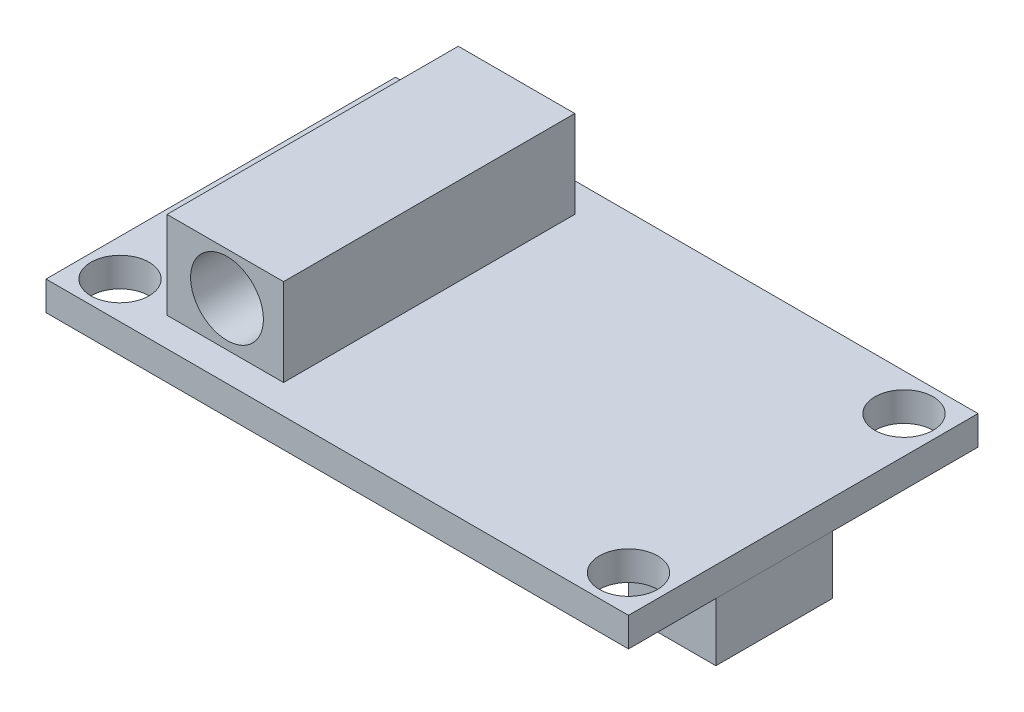
ISO-10303-21;
HEADER;
FILE_DESCRIPTION(('STEP AP214'),'2;1');
FILE_NAME('part.step','',(''),(''),'','','');
FILE_SCHEMA(('AUTOMOTIVE_DESIGN { 1 0 10303 214 1 1 1 1 }'));
ENDSEC;
DATA;
#1=APPLICATION_CONTEXT('core data for automotive mechanical design processes');
#2=APPLICATION_PROTOCOL_DEFINITION('international standard','automotive_design',2000,#1);
#3=PRODUCT_CONTEXT('',#1,'mechanical');
#4=PRODUCT('Part','Part','',(#3));
#5=PRODUCT_RELATED_PRODUCT_CATEGORY('part','',(#4));
#6=PRODUCT_DEFINITION_FORMATION('','',#4);
#7=PRODUCT_DEFINITION_CONTEXT('part definition',#1,'design');
#8=PRODUCT_DEFINITION('design','',#6,#7);
#9=PRODUCT_DEFINITION_SHAPE('','',#8);
#10=(LENGTH_UNIT() NAMED_UNIT(*) SI_UNIT(.MILLI.,.METRE.));
#11=(NAMED_UNIT(*) PLANE_ANGLE_UNIT() SI_UNIT($,.RADIAN.));
#12=(NAMED_UNIT(*) SI_UNIT($,.STERADIAN.) SOLID_ANGLE_UNIT());
#13=UNCERTAINTY_MEASURE_WITH_UNIT(LENGTH_MEASURE(1.E-05),#10,'distance_accuracy_value','');
#14=(GEOMETRIC_REPRESENTATION_CONTEXT(3) GLOBAL_UNCERTAINTY_ASSIGNED_CONTEXT((#13)) GLOBAL_UNIT_ASSIGNED_CONTEXT((#10,
#11,#12)) REPRESENTATION_CONTEXT('',''));
#15=CARTESIAN_POINT('',(0.,0.,0.));
#16=DIRECTION('',(0.,0.,1.));
#17=DIRECTION('',(1.,0.,0.));
#18=AXIS2_PLACEMENT_3D('',#15,#16,#17);
#19=CARTESIAN_POINT('',(11.1125,-3.175,0.));
#20=DIRECTION('',(-1.,0.,0.));
#21=DIRECTION('',(0.,0.,1.));
#22=AXIS2_PLACEMENT_3D('',#19,#20,#21);
#23=PLANE('',#22);
#24=DIRECTION('',(0.,0.,1.));
#25=VECTOR('',#24,1.);
#26=CARTESIAN_POINT('',(11.1125,0.,0.));
#27=LINE('',#26,#25);
#28=CARTESIAN_POINT('',(11.1125,0.,-1.5875));
#29=VERTEX_POINT('',#28);
#30=CARTESIAN_POINT('',(11.1125,0.,4.7625));
#31=VERTEX_POINT('',#30);
#32=EDGE_CURVE('E260',#29,#31,#27,.T.);
#33=ORIENTED_EDGE('',*,*,#32,.F.);
#34=DIRECTION('',(0.,1.,0.));
#35=VECTOR('',#34,1.);
#36=CARTESIAN_POINT('',(11.1125,-3.175,-1.5875));
#37=LINE('',#36,#35);
#38=CARTESIAN_POINT('',(11.1125,-3.175,-1.5875));
#39=VERTEX_POINT('',#38);
#40=EDGE_CURVE('E13',#39,#29,#37,.T.);
#41=ORIENTED_EDGE('',*,*,#40,.F.);
#42=DIRECTION('',(0.,0.,1.));
#43=VECTOR('',#42,1.);
#44=CARTESIAN_POINT('',(11.1125,-3.175,0.));
#45=LINE('',#44,#43);
#46=CARTESIAN_POINT('',(11.1125,-3.175,4.7625));
#47=VERTEX_POINT('',#46);
#48=EDGE_CURVE('E255',#39,#47,#45,.T.);
#49=ORIENTED_EDGE('',*,*,#48,.T.);
#50=DIRECTION('',(0.,1.,0.));
#51=VECTOR('',#50,1.);
#52=CARTESIAN_POINT('',(11.1125,-3.175,4.7625));
#53=LINE('',#52,#51);
#54=EDGE_CURVE('E198',#47,#31,#53,.T.);
#55=ORIENTED_EDGE('',*,*,#54,.T.);
#56=EDGE_LOOP('',(#33,#41,#49,#55));
#57=FACE_BOUND('',#56,.T.);
#58=ADVANCED_FACE('F195',(#57),#23,.T.);
#59=CARTESIAN_POINT('',(0.,-3.175,-1.5875));
#60=DIRECTION('',(0.,0.,1.));
#61=DIRECTION('',(1.,0.,0.));
#62=AXIS2_PLACEMENT_3D('',#59,#60,#61);
#63=PLANE('',#62);
#64=DIRECTION('',(1.,0.,0.));
#65=VECTOR('',#64,1.);
#66=CARTESIAN_POINT('',(0.,0.,-1.5875));
#67=LINE('',#66,#65);
#68=CARTESIAN_POINT('',(15.875,0.,-1.5875));
#69=VERTEX_POINT('',#68);
#70=EDGE_CURVE('E228',#29,#69,#67,.T.);
#71=ORIENTED_EDGE('',*,*,#70,.T.);
#72=DIRECTION('',(0.,1.,0.));
#73=VECTOR('',#72,1.);
#74=CARTESIAN_POINT('',(15.875,-3.175,-1.5875));
#75=LINE('',#74,#73);
#76=CARTESIAN_POINT('',(15.875,-3.175,-1.5875));
#77=VERTEX_POINT('',#76);
#78=EDGE_CURVE('E204',#77,#69,#75,.T.);
#79=ORIENTED_EDGE('',*,*,#78,.F.);
#80=DIRECTION('',(1.,0.,0.));
#81=VECTOR('',#80,1.);
#82=CARTESIAN_POINT('',(0.,-3.175,-1.5875));
#83=LINE('',#82,#81);
#84=EDGE_CURVE('E245',#39,#77,#83,.T.);
#85=ORIENTED_EDGE('',*,*,#84,.F.);
#86=ORIENTED_EDGE('',*,*,#40,.T.);
#87=EDGE_LOOP('',(#71,#79,#85,#86));
#88=FACE_BOUND('',#87,.T.);
#89=ADVANCED_FACE('F270',(#88),#63,.F.);
#90=CARTESIAN_POINT('',(15.875,-3.175,0.));
#91=DIRECTION('',(-1.,0.,0.));
#92=DIRECTION('',(0.,0.,1.));
#93=AXIS2_PLACEMENT_3D('',#90,#91,#92);
#94=PLANE('',#93);
#95=DIRECTION('',(0.,0.,1.));
#96=VECTOR('',#95,1.);
#97=CARTESIAN_POINT('',(15.875,0.,0.));
#98=LINE('',#97,#96);
#99=CARTESIAN_POINT('',(15.875,0.,4.7625));
#100=VERTEX_POINT('',#99);
#101=EDGE_CURVE('E252',#69,#100,#98,.T.);
#102=ORIENTED_EDGE('',*,*,#101,.T.);
#103=DIRECTION('',(0.,1.,0.));
#104=VECTOR('',#103,1.);
#105=CARTESIAN_POINT('',(15.875,-3.175,4.7625));
#106=LINE('',#105,#104);
#107=CARTESIAN_POINT('',(15.875,-3.175,4.7625));
#108=VERTEX_POINT('',#107);
#109=EDGE_CURVE('E249',#108,#100,#106,.T.);
#110=ORIENTED_EDGE('',*,*,#109,.F.);
#111=DIRECTION('',(0.,0.,1.));
#112=VECTOR('',#111,1.);
#113=CARTESIAN_POINT('',(15.875,-3.175,0.));
#114=LINE('',#113,#112);
#115=EDGE_CURVE('E240',#77,#108,#114,.T.);
#116=ORIENTED_EDGE('',*,*,#115,.F.);
#117=ORIENTED_EDGE('',*,*,#78,.T.);
#118=EDGE_LOOP('',(#102,#110,#116,#117));
#119=FACE_BOUND('',#118,.T.);
#120=ADVANCED_FACE('F250',(#119),#94,.F.);
#121=CARTESIAN_POINT('',(0.,-3.175,4.7625));
#122=DIRECTION('',(0.,0.,1.));
#123=DIRECTION('',(1.,0.,0.));
#124=AXIS2_PLACEMENT_3D('',#121,#122,#123);
#125=PLANE('',#124);
#126=DIRECTION('',(1.,0.,0.));
#127=VECTOR('',#126,1.);
#128=CARTESIAN_POINT('',(0.,0.,4.7625));
#129=LINE('',#128,#127);
#130=EDGE_CURVE('E263',#31,#100,#129,.T.);
#131=ORIENTED_EDGE('',*,*,#130,.F.);
#132=ORIENTED_EDGE('',*,*,#54,.F.);
#133=DIRECTION('',(1.,0.,0.));
#134=VECTOR('',#133,1.);
#135=CARTESIAN_POINT('',(0.,-3.175,4.7625));
#136=LINE('',#135,#134);
#137=EDGE_CURVE('E244',#47,#108,#136,.T.);
#138=ORIENTED_EDGE('',*,*,#137,.T.);
#139=ORIENTED_EDGE('',*,*,#109,.T.);
#140=EDGE_LOOP('',(#131,#132,#138,#139));
#141=FACE_BOUND('',#140,.T.);
#142=ADVANCED_FACE('F254',(#141),#125,.T.);
#143=CARTESIAN_POINT('',(0.,-3.175,0.));
#144=DIRECTION('',(0.,1.,0.));
#145=DIRECTION('',(0.,0.,1.));
#146=AXIS2_PLACEMENT_3D('',#143,#144,#145);
#147=PLANE('',#146);
#148=ORIENTED_EDGE('',*,*,#48,.F.);
#149=ORIENTED_EDGE('',*,*,#84,.T.);
#150=ORIENTED_EDGE('',*,*,#115,.T.);
#151=ORIENTED_EDGE('',*,*,#137,.F.);
#152=EDGE_LOOP('',(#148,#149,#150,#151));
#153=FACE_BOUND('',#152,.T.);
#154=ADVANCED_FACE('F243',(#153),#147,.F.);
#155=CARTESIAN_POINT('',(0.,0.,0.));
#156=DIRECTION('',(0.,1.,0.));
#157=DIRECTION('',(0.,0.,1.));
#158=AXIS2_PLACEMENT_3D('',#155,#156,#157);
#159=PLANE('',#158);
#160=ORIENTED_EDGE('',*,*,#32,.T.);
#161=ORIENTED_EDGE('',*,*,#130,.T.);
#162=ORIENTED_EDGE('',*,*,#101,.F.);
#163=ORIENTED_EDGE('',*,*,#70,.F.);
#164=EDGE_LOOP('',(#160,#161,#162,#163));
#165=FACE_BOUND('',#164,.T.);
#166=ADVANCED_FACE('F268',(#165),#159,.T.);
#167=CLOSED_SHELL('',(#58,#89,#120,#142,#154,#166));
#168=MANIFOLD_SOLID_BREP('B2',#167);
#169=CARTESIAN_POINT('',(-11.1125,-3.175,0.));
#170=DIRECTION('',(-1.,0.,0.));
#171=DIRECTION('',(0.,0.,1.));
#172=AXIS2_PLACEMENT_3D('',#169,#170,#171);
#173=PLANE('',#172);
#174=DIRECTION('',(0.,0.,1.));
#175=VECTOR('',#174,1.);
#176=CARTESIAN_POINT('',(-11.1125,0.,0.));
#177=LINE('',#176,#175);
#178=CARTESIAN_POINT('',(-11.1125,0.,-5.55625000000001));
#179=VERTEX_POINT('',#178);
#180=CARTESIAN_POINT('',(-11.1125,0.,0.793749999999992));
#181=VERTEX_POINT('',#180);
#182=EDGE_CURVE('E404',#179,#181,#177,.T.);
#183=ORIENTED_EDGE('',*,*,#182,.T.);
#184=DIRECTION('',(0.,1.,0.));
#185=VECTOR('',#184,1.);
#186=CARTESIAN_POINT('',(-11.1125,-3.175,0.793749999999992));
#187=LINE('',#186,#185);
#188=CARTESIAN_POINT('',(-11.1125,-3.175,0.793749999999992));
#189=VERTEX_POINT('',#188);
#190=EDGE_CURVE('E193',#189,#181,#187,.T.);
#191=ORIENTED_EDGE('',*,*,#190,.F.);
#192=DIRECTION('',(0.,0.,1.));
#193=VECTOR('',#192,1.);
#194=CARTESIAN_POINT('',(-11.1125,-3.175,0.));
#195=LINE('',#194,#193);
#196=CARTESIAN_POINT('',(-11.1125,-3.175,-5.55625000000001));
#197=VERTEX_POINT('',#196);
#198=EDGE_CURVE('E360',#197,#189,#195,.T.);
#199=ORIENTED_EDGE('',*,*,#198,.F.);
#200=DIRECTION('',(0.,1.,0.));
#201=VECTOR('',#200,1.);
#202=CARTESIAN_POINT('',(-11.1125,-3.175,-5.55625000000001));
#203=LINE('',#202,#201);
#204=EDGE_CURVE('E345',#197,#179,#203,.T.);
#205=ORIENTED_EDGE('',*,*,#204,.T.);
#206=EDGE_LOOP('',(#183,#191,#199,#205));
#207=FACE_BOUND('',#206,.T.);
#208=ADVANCED_FACE('F342',(#207),#173,.F.);
#209=CARTESIAN_POINT('',(0.,-3.175,0.793749999999989));
#210=DIRECTION('',(0.,0.,1.));
#211=DIRECTION('',(1.,0.,0.));
#212=AXIS2_PLACEMENT_3D('',#209,#210,#211);
#213=PLANE('',#212);
#214=DIRECTION('',(1.,0.,0.));
#215=VECTOR('',#214,1.);
#216=CARTESIAN_POINT('',(0.,0.,0.793749999999989));
#217=LINE('',#216,#215);
#218=CARTESIAN_POINT('',(-15.875,0.,0.793749999999992));
#219=VERTEX_POINT('',#218);
#220=EDGE_CURVE('E409',#219,#181,#217,.T.);
#221=ORIENTED_EDGE('',*,*,#220,.F.);
#222=DIRECTION('',(0.,1.,0.));
#223=VECTOR('',#222,1.);
#224=CARTESIAN_POINT('',(-15.875,-3.175,0.793749999999992));
#225=LINE('',#224,#223);
#226=CARTESIAN_POINT('',(-15.875,-3.175,0.793749999999992));
#227=VERTEX_POINT('',#226);
#228=EDGE_CURVE('E351',#227,#219,#225,.T.);
#229=ORIENTED_EDGE('',*,*,#228,.F.);
#230=DIRECTION('',(1.,0.,0.));
#231=VECTOR('',#230,1.);
#232=CARTESIAN_POINT('',(0.,-3.175,0.793749999999989));
#233=LINE('',#232,#231);
#234=EDGE_CURVE('E399',#227,#189,#233,.T.);
#235=ORIENTED_EDGE('',*,*,#234,.T.);
#236=ORIENTED_EDGE('',*,*,#190,.T.);
#237=EDGE_LOOP('',(#221,#229,#235,#236));
#238=FACE_BOUND('',#237,.T.);
#239=ADVANCED_FACE('F415',(#238),#213,.T.);
#240=CARTESIAN_POINT('',(-15.875,-3.175,0.));
#241=DIRECTION('',(-1.,0.,0.));
#242=DIRECTION('',(0.,0.,1.));
#243=AXIS2_PLACEMENT_3D('',#240,#241,#242);
#244=PLANE('',#243);
#245=DIRECTION('',(0.,0.,1.));
#246=VECTOR('',#245,1.);
#247=CARTESIAN_POINT('',(-15.875,0.,0.));
#248=LINE('',#247,#246);
#249=CARTESIAN_POINT('',(-15.875,0.,-5.55625000000001));
#250=VERTEX_POINT('',#249);
#251=EDGE_CURVE('E392',#250,#219,#248,.T.);
#252=ORIENTED_EDGE('',*,*,#251,.F.);
#253=DIRECTION('',(0.,1.,0.));
#254=VECTOR('',#253,1.);
#255=CARTESIAN_POINT('',(-15.875,-3.175,-5.55625000000001));
#256=LINE('',#255,#254);
#257=CARTESIAN_POINT('',(-15.875,-3.175,-5.55625000000001));
#258=VERTEX_POINT('',#257);
#259=EDGE_CURVE('E389',#258,#250,#256,.T.);
#260=ORIENTED_EDGE('',*,*,#259,.F.);
#261=DIRECTION('',(0.,0.,1.));
#262=VECTOR('',#261,1.);
#263=CARTESIAN_POINT('',(-15.875,-3.175,0.));
#264=LINE('',#263,#262);
#265=EDGE_CURVE('E391',#258,#227,#264,.T.);
#266=ORIENTED_EDGE('',*,*,#265,.T.);
#267=ORIENTED_EDGE('',*,*,#228,.T.);
#268=EDGE_LOOP('',(#252,#260,#266,#267));
#269=FACE_BOUND('',#268,.T.);
#270=ADVANCED_FACE('F390',(#269),#244,.T.);
#271=CARTESIAN_POINT('',(0.,-3.175,-5.55625000000001));
#272=DIRECTION('',(0.,0.,1.));
#273=DIRECTION('',(1.,0.,0.));
#274=AXIS2_PLACEMENT_3D('',#271,#272,#273);
#275=PLANE('',#274);
#276=DIRECTION('',(1.,0.,0.));
#277=VECTOR('',#276,1.);
#278=CARTESIAN_POINT('',(0.,0.,-5.55625000000001));
#279=LINE('',#278,#277);
#280=EDGE_CURVE('E406',#250,#179,#279,.T.);
#281=ORIENTED_EDGE('',*,*,#280,.T.);
#282=ORIENTED_EDGE('',*,*,#204,.F.);
#283=DIRECTION('',(1.,0.,0.));
#284=VECTOR('',#283,1.);
#285=CARTESIAN_POINT('',(0.,-3.175,-5.55625000000001));
#286=LINE('',#285,#284);
#287=EDGE_CURVE('E386',#258,#197,#286,.T.);
#288=ORIENTED_EDGE('',*,*,#287,.F.);
#289=ORIENTED_EDGE('',*,*,#259,.T.);
#290=EDGE_LOOP('',(#281,#282,#288,#289));
#291=FACE_BOUND('',#290,.T.);
#292=ADVANCED_FACE('F395',(#291),#275,.F.);
#293=CARTESIAN_POINT('',(0.,-3.175,0.));
#294=DIRECTION('',(0.,1.,0.));
#295=DIRECTION('',(0.,0.,1.));
#296=AXIS2_PLACEMENT_3D('',#293,#294,#295);
#297=PLANE('',#296);
#298=ORIENTED_EDGE('',*,*,#198,.T.);
#299=ORIENTED_EDGE('',*,*,#234,.F.);
#300=ORIENTED_EDGE('',*,*,#265,.F.);
#301=ORIENTED_EDGE('',*,*,#287,.T.);
#302=EDGE_LOOP('',(#298,#299,#300,#301));
#303=FACE_BOUND('',#302,.T.);
#304=ADVANCED_FACE('F398',(#303),#297,.F.);
#305=CARTESIAN_POINT('',(0.,0.,0.));
#306=DIRECTION('',(0.,1.,0.));
#307=DIRECTION('',(0.,0.,1.));
#308=AXIS2_PLACEMENT_3D('',#305,#306,#307);
#309=PLANE('',#308);
#310=ORIENTED_EDGE('',*,*,#182,.F.);
#311=ORIENTED_EDGE('',*,*,#280,.F.);
#312=ORIENTED_EDGE('',*,*,#251,.T.);
#313=ORIENTED_EDGE('',*,*,#220,.T.);
#314=EDGE_LOOP('',(#310,#311,#312,#313));
#315=FACE_BOUND('',#314,.T.);
#316=ADVANCED_FACE('F414',(#315),#309,.T.);
#317=CLOSED_SHELL('',(#208,#239,#270,#292,#304,#316));
#318=MANIFOLD_SOLID_BREP('B7',#317);
#319=CARTESIAN_POINT('',(13.8580942622951,1.5875,-7.50809426229511));
#320=DIRECTION('',(0.,-1.,0.));
#321=DIRECTION('',(0.,0.,-1.));
#322=AXIS2_PLACEMENT_3D('',#319,#320,#321);
#323=CYLINDRICAL_SURFACE('',#322,1.5875);
#324=CARTESIAN_POINT('',(13.8580942622951,1.5875,-7.50809426229511));
#325=DIRECTION('',(0.,1.,0.));
#326=DIRECTION('',(0.,0.,1.));
#327=AXIS2_PLACEMENT_3D('',#324,#325,#326);
#328=CIRCLE('',#327,1.5875);
#329=CARTESIAN_POINT('',(13.8580942622951,1.5875,-5.92059426229511));
#330=VERTEX_POINT('',#329);
#331=EDGE_CURVE('E606',#330,#330,#328,.F.);
#332=ORIENTED_EDGE('',*,*,#331,.F.);
#333=EDGE_LOOP('',(#332));
#334=FACE_BOUND('',#333,.T.);
#335=CARTESIAN_POINT('',(13.8580942622951,0.,-7.50809426229511));
#336=DIRECTION('',(0.,1.,0.));
#337=DIRECTION('',(0.,0.,1.));
#338=AXIS2_PLACEMENT_3D('',#335,#336,#337);
#339=CIRCLE('',#338,1.5875);
#340=CARTESIAN_POINT('',(13.8580942622951,0.,-5.92059426229511));
#341=VERTEX_POINT('',#340);
#342=EDGE_CURVE('E590',#341,#341,#339,.F.);
#343=ORIENTED_EDGE('',*,*,#342,.T.);
#344=EDGE_LOOP('',(#343));
#345=FACE_BOUND('',#344,.T.);
#346=ADVANCED_FACE('F480',(#334,#345),#323,.F.);
#347=CARTESIAN_POINT('',(13.8580942622951,1.5875,7.50809426229509));
#348=DIRECTION('',(0.,-1.,0.));
#349=DIRECTION('',(0.,0.,-1.));
#350=AXIS2_PLACEMENT_3D('',#347,#348,#349);
#351=CYLINDRICAL_SURFACE('',#350,1.5875);
#352=CARTESIAN_POINT('',(13.8580942622951,1.5875,7.50809426229509));
#353=DIRECTION('',(0.,1.,0.));
#354=DIRECTION('',(0.,0.,1.));
#355=AXIS2_PLACEMENT_3D('',#352,#353,#354);
#356=CIRCLE('',#355,1.5875);
#357=CARTESIAN_POINT('',(13.8580942622951,1.5875,9.09559426229509));
#358=VERTEX_POINT('',#357);
#359=EDGE_CURVE('E603',#358,#358,#356,.T.);
#360=ORIENTED_EDGE('',*,*,#359,.T.);
#361=EDGE_LOOP('',(#360));
#362=FACE_BOUND('',#361,.T.);
#363=CARTESIAN_POINT('',(13.8580942622951,0.,7.50809426229509));
#364=DIRECTION('',(0.,1.,0.));
#365=DIRECTION('',(0.,0.,1.));
#366=AXIS2_PLACEMENT_3D('',#363,#364,#365);
#367=CIRCLE('',#366,1.5875);
#368=CARTESIAN_POINT('',(13.8580942622951,0.,9.09559426229509));
#369=VERTEX_POINT('',#368);
#370=EDGE_CURVE('E619',#369,#369,#367,.T.);
#371=ORIENTED_EDGE('',*,*,#370,.F.);
#372=EDGE_LOOP('',(#371));
#373=FACE_BOUND('',#372,.T.);
#374=ADVANCED_FACE('F668',(#362,#373),#351,.F.);
#375=CARTESIAN_POINT('',(0.,1.5875,-9.525));
#376=DIRECTION('',(0.,0.,-1.));
#377=DIRECTION('',(-1.,0.,0.));
#378=AXIS2_PLACEMENT_3D('',#375,#376,#377);
#379=PLANE('',#378);
#380=DIRECTION('',(1.,0.,0.));
#381=VECTOR('',#380,1.);
#382=CARTESIAN_POINT('',(0.,0.,-9.525));
#383=LINE('',#382,#381);
#384=CARTESIAN_POINT('',(-15.875,0.,-9.525));
#385=VERTEX_POINT('',#384);
#386=CARTESIAN_POINT('',(15.875,0.,-9.525));
#387=VERTEX_POINT('',#386);
#388=EDGE_CURVE('E615',#385,#387,#383,.T.);
#389=ORIENTED_EDGE('',*,*,#388,.F.);
#390=DIRECTION('',(0.,-1.,0.));
#391=VECTOR('',#390,1.);
#392=CARTESIAN_POINT('',(-15.875,1.5875,-9.525));
#393=LINE('',#392,#391);
#394=CARTESIAN_POINT('',(-15.875,1.5875,-9.525));
#395=VERTEX_POINT('',#394);
#396=EDGE_CURVE('E488',#395,#385,#393,.T.);
#397=ORIENTED_EDGE('',*,*,#396,.F.);
#398=DIRECTION('',(1.,0.,0.));
#399=VECTOR('',#398,1.);
#400=CARTESIAN_POINT('',(0.,1.5875,-9.525));
#401=LINE('',#400,#399);
#402=CARTESIAN_POINT('',(15.875,1.5875,-9.525));
#403=VERTEX_POINT('',#402);
#404=EDGE_CURVE('E595',#395,#403,#401,.T.);
#405=ORIENTED_EDGE('',*,*,#404,.T.);
#406=DIRECTION('',(0.,-1.,0.));
#407=VECTOR('',#406,1.);
#408=CARTESIAN_POINT('',(15.875,1.5875,-9.525));
#409=LINE('',#408,#407);
#410=EDGE_CURVE('E340',#403,#387,#409,.T.);
#411=ORIENTED_EDGE('',*,*,#410,.T.);
#412=EDGE_LOOP('',(#389,#397,#405,#411));
#413=FACE_BOUND('',#412,.T.);
#414=ADVANCED_FACE('F643',(#413),#379,.T.);
#415=CARTESIAN_POINT('',(-15.875,1.5875,0.));
#416=DIRECTION('',(1.,0.,0.));
#417=DIRECTION('',(0.,0.,-1.));
#418=AXIS2_PLACEMENT_3D('',#415,#416,#417);
#419=PLANE('',#418);
#420=DIRECTION('',(0.,0.,1.));
#421=VECTOR('',#420,1.);
#422=CARTESIAN_POINT('',(-15.875,0.,0.));
#423=LINE('',#422,#421);
#424=CARTESIAN_POINT('',(-15.875,0.,9.525));
#425=VERTEX_POINT('',#424);
#426=EDGE_CURVE('E623',#385,#425,#423,.T.);
#427=ORIENTED_EDGE('',*,*,#426,.T.);
#428=DIRECTION('',(0.,-1.,0.));
#429=VECTOR('',#428,1.);
#430=CARTESIAN_POINT('',(-15.875,1.5875,9.525));
#431=LINE('',#430,#429);
#432=CARTESIAN_POINT('',(-15.875,1.5875,9.525));
#433=VERTEX_POINT('',#432);
#434=EDGE_CURVE('E633',#433,#425,#431,.T.);
#435=ORIENTED_EDGE('',*,*,#434,.F.);
#436=DIRECTION('',(0.,0.,1.));
#437=VECTOR('',#436,1.);
#438=CARTESIAN_POINT('',(-15.875,1.5875,0.));
#439=LINE('',#438,#437);
#440=EDGE_CURVE('E598',#395,#433,#439,.T.);
#441=ORIENTED_EDGE('',*,*,#440,.F.);
#442=ORIENTED_EDGE('',*,*,#396,.T.);
#443=EDGE_LOOP('',(#427,#435,#441,#442));
#444=FACE_BOUND('',#443,.T.);
#445=ADVANCED_FACE('F639',(#444),#419,.F.);
#446=CARTESIAN_POINT('',(0.,1.5875,9.525));
#447=DIRECTION('',(0.,0.,-1.));
#448=DIRECTION('',(-1.,0.,0.));
#449=AXIS2_PLACEMENT_3D('',#446,#447,#448);
#450=PLANE('',#449);
#451=DIRECTION('',(1.,0.,0.));
#452=VECTOR('',#451,1.);
#453=CARTESIAN_POINT('',(0.,0.,9.525));
#454=LINE('',#453,#452);
#455=CARTESIAN_POINT('',(15.875,0.,9.525));
#456=VERTEX_POINT('',#455);
#457=EDGE_CURVE('E620',#425,#456,#454,.T.);
#458=ORIENTED_EDGE('',*,*,#457,.T.);
#459=DIRECTION('',(0.,-1.,0.));
#460=VECTOR('',#459,1.);
#461=CARTESIAN_POINT('',(15.875,1.5875,9.525));
#462=LINE('',#461,#460);
#463=CARTESIAN_POINT('',(15.875,1.5875,9.525));
#464=VERTEX_POINT('',#463);
#465=EDGE_CURVE('E609',#464,#456,#462,.T.);
#466=ORIENTED_EDGE('',*,*,#465,.F.);
#467=DIRECTION('',(1.,0.,0.));
#468=VECTOR('',#467,1.);
#469=CARTESIAN_POINT('',(0.,1.5875,9.525));
#470=LINE('',#469,#468);
#471=EDGE_CURVE('E600',#433,#464,#470,.T.);
#472=ORIENTED_EDGE('',*,*,#471,.F.);
#473=ORIENTED_EDGE('',*,*,#434,.T.);
#474=EDGE_LOOP('',(#458,#466,#472,#473));
#475=FACE_BOUND('',#474,.T.);
#476=ADVANCED_FACE('F650',(#475),#450,.F.);
#477=CARTESIAN_POINT('',(15.875,1.5875,0.));
#478=DIRECTION('',(1.,0.,0.));
#479=DIRECTION('',(0.,0.,-1.));
#480=AXIS2_PLACEMENT_3D('',#477,#478,#479);
#481=PLANE('',#480);
#482=DIRECTION('',(0.,0.,1.));
#483=VECTOR('',#482,1.);
#484=CARTESIAN_POINT('',(15.875,0.,0.));
#485=LINE('',#484,#483);
#486=EDGE_CURVE('E616',#387,#456,#485,.T.);
#487=ORIENTED_EDGE('',*,*,#486,.F.);
#488=ORIENTED_EDGE('',*,*,#410,.F.);
#489=DIRECTION('',(0.,0.,1.));
#490=VECTOR('',#489,1.);
#491=CARTESIAN_POINT('',(15.875,1.5875,0.));
#492=LINE('',#491,#490);
#493=EDGE_CURVE('E593',#403,#464,#492,.T.);
#494=ORIENTED_EDGE('',*,*,#493,.T.);
#495=ORIENTED_EDGE('',*,*,#465,.T.);
#496=EDGE_LOOP('',(#487,#488,#494,#495));
#497=FACE_BOUND('',#496,.T.);
#498=ADVANCED_FACE('F656',(#497),#481,.T.);
#499=CARTESIAN_POINT('',(-13.8580942622951,1.5875,-7.5080942622951));
#500=DIRECTION('',(0.,-1.,0.));
#501=DIRECTION('',(0.,0.,-1.));
#502=AXIS2_PLACEMENT_3D('',#499,#500,#501);
#503=CYLINDRICAL_SURFACE('',#502,1.5875);
#504=CARTESIAN_POINT('',(-13.8580942622951,1.5875,-7.5080942622951));
#505=DIRECTION('',(0.,1.,0.));
#506=DIRECTION('',(0.,0.,1.));
#507=AXIS2_PLACEMENT_3D('',#504,#505,#506);
#508=CIRCLE('',#507,1.5875);
#509=CARTESIAN_POINT('',(-13.8580942622951,1.5875,-5.9205942622951));
#510=VERTEX_POINT('',#509);
#511=EDGE_CURVE('E589',#510,#510,#508,.T.);
#512=ORIENTED_EDGE('',*,*,#511,.T.);
#513=EDGE_LOOP('',(#512));
#514=FACE_BOUND('',#513,.T.);
#515=CARTESIAN_POINT('',(-13.8580942622951,0.,-7.5080942622951));
#516=DIRECTION('',(0.,1.,0.));
#517=DIRECTION('',(0.,0.,1.));
#518=AXIS2_PLACEMENT_3D('',#515,#516,#517);
#519=CIRCLE('',#518,1.5875);
#520=CARTESIAN_POINT('',(-13.8580942622951,0.,-5.9205942622951));
#521=VERTEX_POINT('',#520);
#522=EDGE_CURVE('E612',#521,#521,#519,.T.);
#523=ORIENTED_EDGE('',*,*,#522,.F.);
#524=EDGE_LOOP('',(#523));
#525=FACE_BOUND('',#524,.T.);
#526=ADVANCED_FACE('F658',(#514,#525),#503,.F.);
#527=CARTESIAN_POINT('',(-13.8580942622951,1.5875,7.5080942622951));
#528=DIRECTION('',(0.,-1.,0.));
#529=DIRECTION('',(0.,0.,-1.));
#530=AXIS2_PLACEMENT_3D('',#527,#528,#529);
#531=CYLINDRICAL_SURFACE('',#530,1.5875);
#532=CARTESIAN_POINT('',(-13.8580942622951,1.5875,7.5080942622951));
#533=DIRECTION('',(0.,1.,0.));
#534=DIRECTION('',(0.,0.,1.));
#535=AXIS2_PLACEMENT_3D('',#532,#533,#534);
#536=CIRCLE('',#535,1.5875);
#537=CARTESIAN_POINT('',(-13.8580942622951,1.5875,9.0955942622951));
#538=VERTEX_POINT('',#537);
#539=EDGE_CURVE('E586',#538,#538,#536,.F.);
#540=ORIENTED_EDGE('',*,*,#539,.F.);
#541=EDGE_LOOP('',(#540));
#542=FACE_BOUND('',#541,.T.);
#543=CARTESIAN_POINT('',(-13.8580942622951,0.,7.5080942622951));
#544=DIRECTION('',(0.,1.,0.));
#545=DIRECTION('',(0.,0.,1.));
#546=AXIS2_PLACEMENT_3D('',#543,#544,#545);
#547=CIRCLE('',#546,1.5875);
#548=CARTESIAN_POINT('',(-13.8580942622951,0.,9.0955942622951));
#549=VERTEX_POINT('',#548);
#550=EDGE_CURVE('E581',#549,#549,#547,.F.);
#551=ORIENTED_EDGE('',*,*,#550,.T.);
#552=EDGE_LOOP('',(#551));
#553=FACE_BOUND('',#552,.T.);
#554=ADVANCED_FACE('F482',(#542,#553),#531,.F.);
#555=CARTESIAN_POINT('',(0.,0.,0.));
#556=DIRECTION('',(0.,1.,0.));
#557=DIRECTION('',(0.,0.,1.));
#558=AXIS2_PLACEMENT_3D('',#555,#556,#557);
#559=PLANE('',#558);
#560=ORIENTED_EDGE('',*,*,#388,.T.);
#561=ORIENTED_EDGE('',*,*,#486,.T.);
#562=ORIENTED_EDGE('',*,*,#457,.F.);
#563=ORIENTED_EDGE('',*,*,#426,.F.);
#564=EDGE_LOOP('',(#560,#561,#562,#563));
#565=FACE_BOUND('',#564,.T.);
#566=ORIENTED_EDGE('',*,*,#550,.F.);
#567=EDGE_LOOP('',(#566));
#568=FACE_BOUND('',#567,.T.);
#569=ORIENTED_EDGE('',*,*,#522,.T.);
#570=EDGE_LOOP('',(#569));
#571=FACE_BOUND('',#570,.T.);
#572=ORIENTED_EDGE('',*,*,#370,.T.);
#573=EDGE_LOOP('',(#572));
#574=FACE_BOUND('',#573,.T.);
#575=ORIENTED_EDGE('',*,*,#342,.F.);
#576=EDGE_LOOP('',(#575));
#577=FACE_BOUND('',#576,.T.);
#578=ADVANCED_FACE('F645',(#565,#568,#571,#574,#577),#559,.F.);
#579=CARTESIAN_POINT('',(0.,1.5875,0.));
#580=DIRECTION('',(0.,1.,0.));
#581=DIRECTION('',(0.,0.,1.));
#582=AXIS2_PLACEMENT_3D('',#579,#580,#581);
#583=PLANE('',#582);
#584=DIRECTION('',(-1.,0.,0.));
#585=VECTOR('',#584,1.);
#586=CARTESIAN_POINT('',(0.,1.5875,7.93749999999999));
#587=LINE('',#586,#585);
#588=CARTESIAN_POINT('',(-4.51526639344264,1.5875,7.93749999999999));
#589=VERTEX_POINT('',#588);
#590=CARTESIAN_POINT('',(-10.8652663934426,1.5875,7.93749999999999));
#591=VERTEX_POINT('',#590);
#592=EDGE_CURVE('E575',#589,#591,#587,.T.);
#593=ORIENTED_EDGE('',*,*,#592,.T.);
#594=DIRECTION('',(0.,0.,-1.));
#595=VECTOR('',#594,1.);
#596=CARTESIAN_POINT('',(-10.8652663934426,1.5875,0.));
#597=LINE('',#596,#595);
#598=CARTESIAN_POINT('',(-10.8652663934426,1.5875,-7.93750000000001));
#599=VERTEX_POINT('',#598);
#600=EDGE_CURVE('E549',#591,#599,#597,.T.);
#601=ORIENTED_EDGE('',*,*,#600,.T.);
#602=DIRECTION('',(-1.,0.,0.));
#603=VECTOR('',#602,1.);
#604=CARTESIAN_POINT('',(0.,1.5875,-7.93750000000001));
#605=LINE('',#604,#603);
#606=CARTESIAN_POINT('',(-4.51526639344264,1.5875,-7.93750000000001));
#607=VERTEX_POINT('',#606);
#608=EDGE_CURVE('E500',#607,#599,#605,.T.);
#609=ORIENTED_EDGE('',*,*,#608,.F.);
#610=DIRECTION('',(0.,0.,-1.));
#611=VECTOR('',#610,1.);
#612=CARTESIAN_POINT('',(-4.51526639344264,1.5875,0.));
#613=LINE('',#612,#611);
#614=EDGE_CURVE('E495',#589,#607,#613,.T.);
#615=ORIENTED_EDGE('',*,*,#614,.F.);
#616=EDGE_LOOP('',(#593,#601,#609,#615));
#617=FACE_BOUND('',#616,.T.);
#618=ORIENTED_EDGE('',*,*,#471,.T.);
#619=ORIENTED_EDGE('',*,*,#493,.F.);
#620=ORIENTED_EDGE('',*,*,#404,.F.);
#621=ORIENTED_EDGE('',*,*,#440,.T.);
#622=EDGE_LOOP('',(#618,#619,#620,#621));
#623=FACE_BOUND('',#622,.T.);
#624=ORIENTED_EDGE('',*,*,#539,.T.);
#625=EDGE_LOOP('',(#624));
#626=FACE_BOUND('',#625,.T.);
#627=ORIENTED_EDGE('',*,*,#511,.F.);
#628=EDGE_LOOP('',(#627));
#629=FACE_BOUND('',#628,.T.);
#630=ORIENTED_EDGE('',*,*,#359,.F.);
#631=EDGE_LOOP('',(#630));
#632=FACE_BOUND('',#631,.T.);
#633=ORIENTED_EDGE('',*,*,#331,.T.);
#634=EDGE_LOOP('',(#633));
#635=FACE_BOUND('',#634,.T.);
#636=ADVANCED_FACE('F653',(#617,#623,#626,#629,#632,#635),#583,.T.);
#637=CARTESIAN_POINT('',(0.,6.35,7.93749999999999));
#638=DIRECTION('',(0.,0.,1.));
#639=DIRECTION('',(1.,0.,0.));
#640=AXIS2_PLACEMENT_3D('',#637,#638,#639);
#641=PLANE('',#640);
#642=CARTESIAN_POINT('',(-7.59661036465575,4.0184153166899,7.93749999999999));
#643=DIRECTION('',(0.,0.,1.));
#644=DIRECTION('',(1.,0.,0.));
#645=AXIS2_PLACEMENT_3D('',#642,#643,#644);
#646=CIRCLE('',#645,1.984375);
#647=CARTESIAN_POINT('',(-5.61223536465575,4.0184153166899,7.93749999999999));
#648=VERTEX_POINT('',#647);
#649=EDGE_CURVE('E570',#648,#648,#646,.T.);
#650=ORIENTED_EDGE('',*,*,#649,.F.);
#651=EDGE_LOOP('',(#650));
#652=FACE_BOUND('',#651,.T.);
#653=ORIENTED_EDGE('',*,*,#592,.F.);
#654=DIRECTION('',(0.,-1.,0.));
#655=VECTOR('',#654,1.);
#656=CARTESIAN_POINT('',(-4.51526639344264,6.35,7.93749999999999));
#657=LINE('',#656,#655);
#658=CARTESIAN_POINT('',(-4.51526639344264,6.35,7.93749999999999));
#659=VERTEX_POINT('',#658);
#660=EDGE_CURVE('E565',#659,#589,#657,.T.);
#661=ORIENTED_EDGE('',*,*,#660,.F.);
#662=DIRECTION('',(-1.,0.,0.));
#663=VECTOR('',#662,1.);
#664=CARTESIAN_POINT('',(0.,6.35,7.93749999999999));
#665=LINE('',#664,#663);
#666=CARTESIAN_POINT('',(-10.8652663934426,6.35,7.93749999999999));
#667=VERTEX_POINT('',#666);
#668=EDGE_CURVE('E559',#659,#667,#665,.T.);
#669=ORIENTED_EDGE('',*,*,#668,.T.);
#670=DIRECTION('',(0.,-1.,0.));
#671=VECTOR('',#670,1.);
#672=CARTESIAN_POINT('',(-10.8652663934426,6.35,7.93749999999999));
#673=LINE('',#672,#671);
#674=EDGE_CURVE('E544',#667,#591,#673,.T.);
#675=ORIENTED_EDGE('',*,*,#674,.T.);
#676=EDGE_LOOP('',(#653,#661,#669,#675));
#677=FACE_BOUND('',#676,.T.);
#678=ADVANCED_FACE('F564',(#652,#677),#641,.T.);
#679=CARTESIAN_POINT('',(-4.51526639344264,6.35,0.));
#680=DIRECTION('',(-1.,0.,0.));
#681=DIRECTION('',(0.,0.,1.));
#682=AXIS2_PLACEMENT_3D('',#679,#680,#681);
#683=PLANE('',#682);
#684=ORIENTED_EDGE('',*,*,#614,.T.);
#685=DIRECTION('',(0.,-1.,0.));
#686=VECTOR('',#685,1.);
#687=CARTESIAN_POINT('',(-4.51526639344264,6.35,-7.93750000000001));
#688=LINE('',#687,#686);
#689=CARTESIAN_POINT('',(-4.51526639344264,6.35,-7.93750000000001));
#690=VERTEX_POINT('',#689);
#691=EDGE_CURVE('E582',#690,#607,#688,.T.);
#692=ORIENTED_EDGE('',*,*,#691,.F.);
#693=DIRECTION('',(0.,0.,-1.));
#694=VECTOR('',#693,1.);
#695=CARTESIAN_POINT('',(-4.51526639344264,6.35,0.));
#696=LINE('',#695,#694);
#697=EDGE_CURVE('E554',#659,#690,#696,.T.);
#698=ORIENTED_EDGE('',*,*,#697,.F.);
#699=ORIENTED_EDGE('',*,*,#660,.T.);
#700=EDGE_LOOP('',(#684,#692,#698,#699));
#701=FACE_BOUND('',#700,.T.);
#702=ADVANCED_FACE('F684',(#701),#683,.F.);
#703=CARTESIAN_POINT('',(0.,6.35,-7.93750000000001));
#704=DIRECTION('',(0.,0.,1.));
#705=DIRECTION('',(1.,0.,0.));
#706=AXIS2_PLACEMENT_3D('',#703,#704,#705);
#707=PLANE('',#706);
#708=ORIENTED_EDGE('',*,*,#608,.T.);
#709=DIRECTION('',(0.,-1.,0.));
#710=VECTOR('',#709,1.);
#711=CARTESIAN_POINT('',(-10.8652663934426,6.35,-7.93750000000001));
#712=LINE('',#711,#710);
#713=CARTESIAN_POINT('',(-10.8652663934426,6.35,-7.93750000000001));
#714=VERTEX_POINT('',#713);
#715=EDGE_CURVE('E553',#714,#599,#712,.T.);
#716=ORIENTED_EDGE('',*,*,#715,.F.);
#717=DIRECTION('',(-1.,0.,0.));
#718=VECTOR('',#717,1.);
#719=CARTESIAN_POINT('',(0.,6.35,-7.93750000000001));
#720=LINE('',#719,#718);
#721=EDGE_CURVE('E561',#690,#714,#720,.T.);
#722=ORIENTED_EDGE('',*,*,#721,.F.);
#723=ORIENTED_EDGE('',*,*,#691,.T.);
#724=EDGE_LOOP('',(#708,#716,#722,#723));
#725=FACE_BOUND('',#724,.T.);
#726=ADVANCED_FACE('F688',(#725),#707,.F.);
#727=CARTESIAN_POINT('',(-10.8652663934426,6.35,0.));
#728=DIRECTION('',(-1.,0.,0.));
#729=DIRECTION('',(0.,0.,1.));
#730=AXIS2_PLACEMENT_3D('',#727,#728,#729);
#731=PLANE('',#730);
#732=ORIENTED_EDGE('',*,*,#600,.F.);
#733=ORIENTED_EDGE('',*,*,#674,.F.);
#734=DIRECTION('',(0.,0.,-1.));
#735=VECTOR('',#734,1.);
#736=CARTESIAN_POINT('',(-10.8652663934426,6.35,0.));
#737=LINE('',#736,#735);
#738=EDGE_CURVE('E548',#667,#714,#737,.T.);
#739=ORIENTED_EDGE('',*,*,#738,.T.);
#740=ORIENTED_EDGE('',*,*,#715,.T.);
#741=EDGE_LOOP('',(#732,#733,#739,#740));
#742=FACE_BOUND('',#741,.T.);
#743=ADVANCED_FACE('F546',(#742),#731,.T.);
#744=CARTESIAN_POINT('',(0.,6.35,0.));
#745=DIRECTION('',(0.,-1.,0.));
#746=DIRECTION('',(0.,0.,-1.));
#747=AXIS2_PLACEMENT_3D('',#744,#745,#746);
#748=PLANE('',#747);
#749=ORIENTED_EDGE('',*,*,#668,.F.);
#750=ORIENTED_EDGE('',*,*,#697,.T.);
#751=ORIENTED_EDGE('',*,*,#721,.T.);
#752=ORIENTED_EDGE('',*,*,#738,.F.);
#753=EDGE_LOOP('',(#749,#750,#751,#752));
#754=FACE_BOUND('',#753,.T.);
#755=ADVANCED_FACE('F558',(#754),#748,.F.);
#756=CARTESIAN_POINT('',(-7.59661036465575,4.0184153166899,-4.82500000000001));
#757=DIRECTION('',(0.,0.,1.));
#758=DIRECTION('',(1.,0.,0.));
#759=AXIS2_PLACEMENT_3D('',#756,#757,#758);
#760=CYLINDRICAL_SURFACE('',#759,1.984375);
#761=CARTESIAN_POINT('',(-7.59661036465575,4.0184153166899,-4.82500000000001));
#762=DIRECTION('',(0.,0.,1.));
#763=DIRECTION('',(1.,0.,0.));
#764=AXIS2_PLACEMENT_3D('',#761,#762,#763);
#765=CIRCLE('',#764,1.984375);
#766=CARTESIAN_POINT('',(-5.61223536465575,4.0184153166899,-4.82500000000001));
#767=VERTEX_POINT('',#766);
#768=EDGE_CURVE('E577',#767,#767,#765,.T.);
#769=ORIENTED_EDGE('',*,*,#768,.F.);
#770=EDGE_LOOP('',(#769));
#771=FACE_BOUND('',#770,.T.);
#772=ORIENTED_EDGE('',*,*,#649,.T.);
#773=EDGE_LOOP('',(#772));
#774=FACE_BOUND('',#773,.T.);
#775=ADVANCED_FACE('F697',(#771,#774),#760,.F.);
#776=CARTESIAN_POINT('',(-7.59661036465575,4.0184153166899,-4.82500000000001));
#777=DIRECTION('',(0.,0.,1.));
#778=DIRECTION('',(1.,0.,0.));
#779=AXIS2_PLACEMENT_3D('',#776,#777,#778);
#780=PLANE('',#779);
#781=ORIENTED_EDGE('',*,*,#768,.T.);
#782=EDGE_LOOP('',(#781));
#783=FACE_BOUND('',#782,.T.);
#784=ADVANCED_FACE('F700',(#783),#780,.T.);
#785=CLOSED_SHELL('',(#346,#374,#414,#445,#476,#498,#526,#554,#578,#636,#678,#702,#726,#743,
#755,#775,#784));
#786=MANIFOLD_SOLID_BREP('B187',#785);
#787=ADVANCED_BREP_SHAPE_REPRESENTATION('',(#18,#168,#318,#786),#14);
#788=SHAPE_DEFINITION_REPRESENTATION(#9,#787);
ENDSEC;
END-ISO-10303-21;
